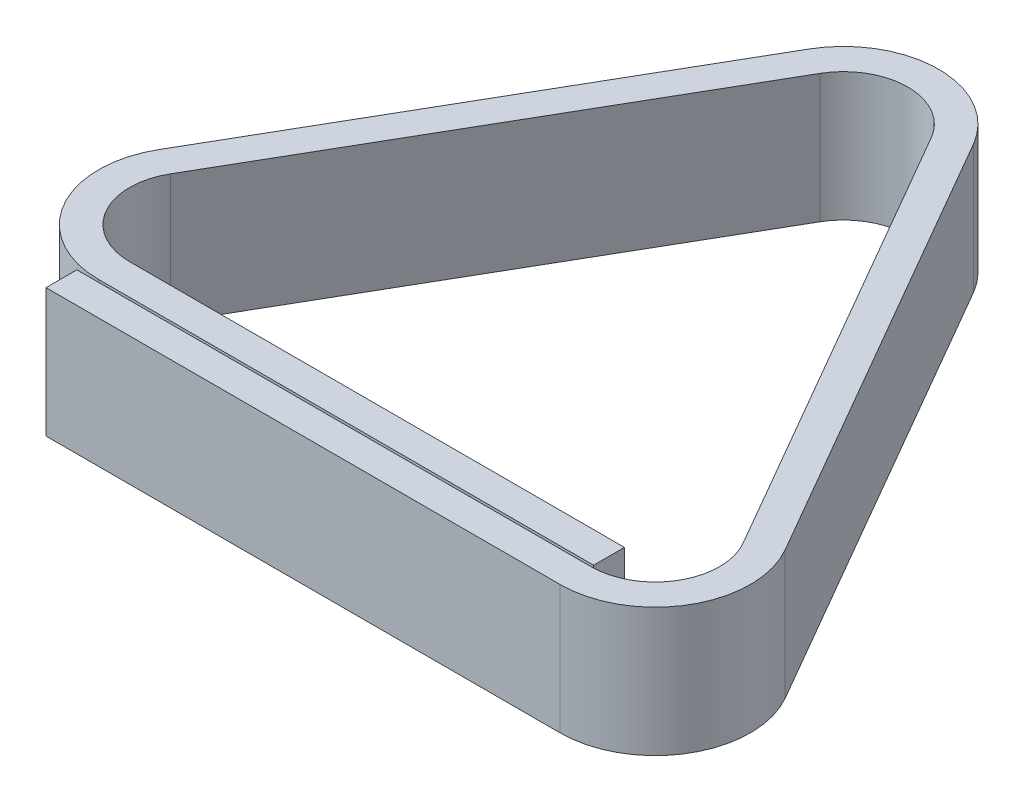
ISO-10303-21;
HEADER;
FILE_DESCRIPTION(('STEP AP214'),'2;1');
FILE_NAME('part.step','',(''),(''),'','','');
FILE_SCHEMA(('AUTOMOTIVE_DESIGN { 1 0 10303 214 1 1 1 1 }'));
ENDSEC;
DATA;
#1=APPLICATION_CONTEXT('core data for automotive mechanical design processes');
#2=APPLICATION_PROTOCOL_DEFINITION('international standard','automotive_design',2000,#1);
#3=PRODUCT_CONTEXT('',#1,'mechanical');
#4=PRODUCT('Part','Part','',(#3));
#5=PRODUCT_RELATED_PRODUCT_CATEGORY('part','',(#4));
#6=PRODUCT_DEFINITION_FORMATION('','',#4);
#7=PRODUCT_DEFINITION_CONTEXT('part definition',#1,'design');
#8=PRODUCT_DEFINITION('design','',#6,#7);
#9=PRODUCT_DEFINITION_SHAPE('','',#8);
#10=(LENGTH_UNIT() NAMED_UNIT(*) SI_UNIT(.MILLI.,.METRE.));
#11=(NAMED_UNIT(*) PLANE_ANGLE_UNIT() SI_UNIT($,.RADIAN.));
#12=(NAMED_UNIT(*) SI_UNIT($,.STERADIAN.) SOLID_ANGLE_UNIT());
#13=UNCERTAINTY_MEASURE_WITH_UNIT(LENGTH_MEASURE(1.E-05),#10,'distance_accuracy_value','');
#14=(GEOMETRIC_REPRESENTATION_CONTEXT(3) GLOBAL_UNCERTAINTY_ASSIGNED_CONTEXT((#13)) GLOBAL_UNIT_ASSIGNED_CONTEXT((#10,
#11,#12)) REPRESENTATION_CONTEXT('',''));
#15=CARTESIAN_POINT('',(0.,0.,0.));
#16=DIRECTION('',(0.,0.,1.));
#17=DIRECTION('',(1.,0.,0.));
#18=AXIS2_PLACEMENT_3D('',#15,#16,#17);
#19=CARTESIAN_POINT('',(0.,10.,0.));
#20=DIRECTION('',(1.,0.,0.));
#21=DIRECTION('',(0.,0.,-1.));
#22=AXIS2_PLACEMENT_3D('',#19,#20,#21);
#23=PLANE('',#22);
#24=DIRECTION('',(0.,0.,1.));
#25=VECTOR('',#24,1.);
#26=CARTESIAN_POINT('',(0.,0.,0.));
#27=LINE('',#26,#25);
#28=CARTESIAN_POINT('',(0.,0.,0.));
#29=VERTEX_POINT('',#28);
#30=CARTESIAN_POINT('',(0.,0.,2.4));
#31=VERTEX_POINT('',#30);
#32=EDGE_CURVE('E177',#29,#31,#27,.T.);
#33=ORIENTED_EDGE('',*,*,#32,.T.);
#34=DIRECTION('',(0.,-1.,0.));
#35=VECTOR('',#34,1.);
#36=CARTESIAN_POINT('',(0.,10.,2.4));
#37=LINE('',#36,#35);
#38=CARTESIAN_POINT('',(0.,10.,2.4));
#39=VERTEX_POINT('',#38);
#40=EDGE_CURVE('E11',#39,#31,#37,.T.);
#41=ORIENTED_EDGE('',*,*,#40,.F.);
#42=DIRECTION('',(0.,0.,1.));
#43=VECTOR('',#42,1.);
#44=CARTESIAN_POINT('',(0.,10.,0.));
#45=LINE('',#44,#43);
#46=CARTESIAN_POINT('',(0.,10.,0.));
#47=VERTEX_POINT('',#46);
#48=EDGE_CURVE('E207',#47,#39,#45,.T.);
#49=ORIENTED_EDGE('',*,*,#48,.F.);
#50=DIRECTION('',(0.,-1.,0.));
#51=VECTOR('',#50,1.);
#52=CARTESIAN_POINT('',(0.,10.,0.));
#53=LINE('',#52,#51);
#54=EDGE_CURVE('E173',#47,#29,#53,.T.);
#55=ORIENTED_EDGE('',*,*,#54,.T.);
#56=EDGE_LOOP('',(#33,#41,#49,#55));
#57=FACE_BOUND('',#56,.T.);
#58=ADVANCED_FACE('F33',(#57),#23,.F.);
#59=CARTESIAN_POINT('',(0.,10.,2.4));
#60=DIRECTION('',(0.,0.,-1.));
#61=DIRECTION('',(-1.,0.,0.));
#62=AXIS2_PLACEMENT_3D('',#59,#60,#61);
#63=PLANE('',#62);
#64=DIRECTION('',(1.,0.,0.));
#65=VECTOR('',#64,1.);
#66=CARTESIAN_POINT('',(0.,0.,2.4));
#67=LINE('',#66,#65);
#68=CARTESIAN_POINT('',(40.,0.,2.4));
#69=VERTEX_POINT('',#68);
#70=EDGE_CURVE('E180',#31,#69,#67,.T.);
#71=ORIENTED_EDGE('',*,*,#70,.T.);
#72=DIRECTION('',(0.,-1.,0.));
#73=VECTOR('',#72,1.);
#74=CARTESIAN_POINT('',(40.,10.,2.4));
#75=LINE('',#74,#73);
#76=CARTESIAN_POINT('',(40.,10.,2.4));
#77=VERTEX_POINT('',#76);
#78=EDGE_CURVE('E41',#77,#69,#75,.T.);
#79=ORIENTED_EDGE('',*,*,#78,.F.);
#80=DIRECTION('',(1.,0.,0.));
#81=VECTOR('',#80,1.);
#82=CARTESIAN_POINT('',(0.,10.,2.4));
#83=LINE('',#82,#81);
#84=EDGE_CURVE('E116',#39,#77,#83,.T.);
#85=ORIENTED_EDGE('',*,*,#84,.F.);
#86=ORIENTED_EDGE('',*,*,#40,.T.);
#87=EDGE_LOOP('',(#71,#79,#85,#86));
#88=FACE_BOUND('',#87,.T.);
#89=ADVANCED_FACE('F305',(#88),#63,.F.);
#90=CARTESIAN_POINT('',(40.,10.,-5.));
#91=DIRECTION('',(0.,-1.,0.));
#92=DIRECTION('',(0.,0.,-1.));
#93=AXIS2_PLACEMENT_3D('',#90,#91,#92);
#94=CYLINDRICAL_SURFACE('',#93,7.4);
#95=CARTESIAN_POINT('',(40.,0.,-5.));
#96=DIRECTION('',(0.,1.,0.));
#97=DIRECTION('',(0.,0.,1.));
#98=AXIS2_PLACEMENT_3D('',#95,#96,#97);
#99=CIRCLE('',#98,7.4);
#100=CARTESIAN_POINT('',(46.4085879880048,0.,-8.70000000000003));
#101=VERTEX_POINT('',#100);
#102=EDGE_CURVE('E182',#69,#101,#99,.T.);
#103=ORIENTED_EDGE('',*,*,#102,.T.);
#104=DIRECTION('',(0.,-1.,0.));
#105=VECTOR('',#104,1.);
#106=CARTESIAN_POINT('',(46.4085879880048,10.,-8.70000000000003));
#107=LINE('',#106,#105);
#108=CARTESIAN_POINT('',(46.4085879880048,10.,-8.70000000000003));
#109=VERTEX_POINT('',#108);
#110=EDGE_CURVE('E238',#109,#101,#107,.T.);
#111=ORIENTED_EDGE('',*,*,#110,.F.);
#112=CARTESIAN_POINT('',(40.,10.,-5.));
#113=DIRECTION('',(0.,1.,0.));
#114=DIRECTION('',(0.,0.,1.));
#115=AXIS2_PLACEMENT_3D('',#112,#113,#114);
#116=CIRCLE('',#115,7.4);
#117=EDGE_CURVE('E246',#77,#109,#116,.T.);
#118=ORIENTED_EDGE('',*,*,#117,.F.);
#119=ORIENTED_EDGE('',*,*,#78,.T.);
#120=EDGE_LOOP('',(#103,#111,#118,#119));
#121=FACE_BOUND('',#120,.T.);
#122=ADVANCED_FACE('F244',(#121),#94,.T.);
#123=CARTESIAN_POINT('',(46.4085879880048,10.,-8.70000000000003));
#124=DIRECTION('',(-0.866025403784436,0.,0.500000000000004));
#125=DIRECTION('',(0.500000000000004,0.,0.866025403784436));
#126=AXIS2_PLACEMENT_3D('',#123,#124,#125);
#127=PLANE('',#126);
#128=DIRECTION('',(-0.500000000000004,0.,-0.866025403784436));
#129=VECTOR('',#128,1.);
#130=CARTESIAN_POINT('',(46.4085879880048,0.,-8.70000000000003));
#131=LINE('',#130,#129);
#132=CARTESIAN_POINT('',(26.4085879880047,0.,-43.3410161513775));
#133=VERTEX_POINT('',#132);
#134=EDGE_CURVE('E184',#101,#133,#131,.T.);
#135=ORIENTED_EDGE('',*,*,#134,.T.);
#136=DIRECTION('',(0.,-1.,0.));
#137=VECTOR('',#136,1.);
#138=CARTESIAN_POINT('',(26.4085879880047,10.,-43.3410161513775));
#139=LINE('',#138,#137);
#140=CARTESIAN_POINT('',(26.4085879880047,10.,-43.3410161513775));
#141=VERTEX_POINT('',#140);
#142=EDGE_CURVE('E235',#141,#133,#139,.T.);
#143=ORIENTED_EDGE('',*,*,#142,.F.);
#144=DIRECTION('',(-0.500000000000004,0.,-0.866025403784436));
#145=VECTOR('',#144,1.);
#146=CARTESIAN_POINT('',(46.4085879880048,10.,-8.70000000000003));
#147=LINE('',#146,#145);
#148=EDGE_CURVE('E264',#109,#141,#147,.T.);
#149=ORIENTED_EDGE('',*,*,#148,.F.);
#150=ORIENTED_EDGE('',*,*,#110,.T.);
#151=EDGE_LOOP('',(#135,#143,#149,#150));
#152=FACE_BOUND('',#151,.T.);
#153=ADVANCED_FACE('F255',(#152),#127,.F.);
#154=CARTESIAN_POINT('',(19.9999999999998,10.,-39.6410161513774));
#155=DIRECTION('',(0.,-1.,0.));
#156=DIRECTION('',(0.,0.,-1.));
#157=AXIS2_PLACEMENT_3D('',#154,#155,#156);
#158=CYLINDRICAL_SURFACE('',#157,7.4);
#159=CARTESIAN_POINT('',(19.9999999999998,0.,-39.6410161513774));
#160=DIRECTION('',(0.,1.,0.));
#161=DIRECTION('',(0.,0.,1.));
#162=AXIS2_PLACEMENT_3D('',#159,#160,#161);
#163=CIRCLE('',#162,7.4);
#164=CARTESIAN_POINT('',(13.591412011995,0.,-43.3410161513775));
#165=VERTEX_POINT('',#164);
#166=EDGE_CURVE('E186',#133,#165,#163,.T.);
#167=ORIENTED_EDGE('',*,*,#166,.T.);
#168=DIRECTION('',(0.,-1.,0.));
#169=VECTOR('',#168,1.);
#170=CARTESIAN_POINT('',(13.591412011995,10.,-43.3410161513775));
#171=LINE('',#170,#169);
#172=CARTESIAN_POINT('',(13.591412011995,10.,-43.3410161513775));
#173=VERTEX_POINT('',#172);
#174=EDGE_CURVE('E232',#173,#165,#171,.T.);
#175=ORIENTED_EDGE('',*,*,#174,.F.);
#176=CARTESIAN_POINT('',(19.9999999999998,10.,-39.6410161513774));
#177=DIRECTION('',(0.,1.,0.));
#178=DIRECTION('',(0.,0.,1.));
#179=AXIS2_PLACEMENT_3D('',#176,#177,#178);
#180=CIRCLE('',#179,7.4);
#181=EDGE_CURVE('E261',#141,#173,#180,.T.);
#182=ORIENTED_EDGE('',*,*,#181,.F.);
#183=ORIENTED_EDGE('',*,*,#142,.T.);
#184=EDGE_LOOP('',(#167,#175,#182,#183));
#185=FACE_BOUND('',#184,.T.);
#186=ADVANCED_FACE('F259',(#185),#158,.T.);
#187=CARTESIAN_POINT('',(13.591412011995,10.,-43.3410161513775));
#188=DIRECTION('',(0.866025403784438,0.,0.5));
#189=DIRECTION('',(0.5,0.,-0.866025403784439));
#190=AXIS2_PLACEMENT_3D('',#187,#188,#189);
#191=PLANE('',#190);
#192=DIRECTION('',(-0.5,0.,0.866025403784438));
#193=VECTOR('',#192,1.);
#194=CARTESIAN_POINT('',(13.591412011995,0.,-43.3410161513775));
#195=LINE('',#194,#193);
#196=CARTESIAN_POINT('',(-4.90747728811198,0.,-11.2999999999999));
#197=VERTEX_POINT('',#196);
#198=EDGE_CURVE('E188',#165,#197,#195,.T.);
#199=ORIENTED_EDGE('',*,*,#198,.T.);
#200=DIRECTION('',(0.,-1.,0.));
#201=VECTOR('',#200,1.);
#202=CARTESIAN_POINT('',(-4.90747728811198,10.,-11.2999999999999));
#203=LINE('',#202,#201);
#204=CARTESIAN_POINT('',(-4.90747728811198,10.,-11.2999999999999));
#205=VERTEX_POINT('',#204);
#206=EDGE_CURVE('E229',#205,#197,#203,.T.);
#207=ORIENTED_EDGE('',*,*,#206,.F.);
#208=DIRECTION('',(-0.5,0.,0.866025403784438));
#209=VECTOR('',#208,1.);
#210=CARTESIAN_POINT('',(13.591412011995,10.,-43.3410161513775));
#211=LINE('',#210,#209);
#212=EDGE_CURVE('E263',#173,#205,#211,.T.);
#213=ORIENTED_EDGE('',*,*,#212,.F.);
#214=ORIENTED_EDGE('',*,*,#174,.T.);
#215=EDGE_LOOP('',(#199,#207,#213,#214));
#216=FACE_BOUND('',#215,.T.);
#217=ADVANCED_FACE('F318',(#216),#191,.F.);
#218=CARTESIAN_POINT('',(1.50111069989287,10.,-7.59999999999994));
#219=DIRECTION('',(0.,-1.,0.));
#220=DIRECTION('',(0.,0.,-1.));
#221=AXIS2_PLACEMENT_3D('',#218,#219,#220);
#222=CYLINDRICAL_SURFACE('',#221,7.4);
#223=CARTESIAN_POINT('',(1.50111069989287,0.,-7.59999999999994));
#224=DIRECTION('',(0.,1.,0.));
#225=DIRECTION('',(0.,0.,1.));
#226=AXIS2_PLACEMENT_3D('',#223,#224,#225);
#227=CIRCLE('',#226,7.4);
#228=CARTESIAN_POINT('',(1.50111069989288,0.,-0.199999999999939));
#229=VERTEX_POINT('',#228);
#230=EDGE_CURVE('E190',#197,#229,#227,.T.);
#231=ORIENTED_EDGE('',*,*,#230,.T.);
#232=DIRECTION('',(0.,-1.,0.));
#233=VECTOR('',#232,1.);
#234=CARTESIAN_POINT('',(1.50111069989288,10.,-0.199999999999939));
#235=LINE('',#234,#233);
#236=CARTESIAN_POINT('',(1.50111069989288,10.,-0.199999999999939));
#237=VERTEX_POINT('',#236);
#238=EDGE_CURVE('E226',#237,#229,#235,.T.);
#239=ORIENTED_EDGE('',*,*,#238,.F.);
#240=CARTESIAN_POINT('',(1.50111069989287,10.,-7.59999999999994));
#241=DIRECTION('',(0.,1.,0.));
#242=DIRECTION('',(0.,0.,1.));
#243=AXIS2_PLACEMENT_3D('',#240,#241,#242);
#244=CIRCLE('',#243,7.4);
#245=EDGE_CURVE('E266',#205,#237,#244,.T.);
#246=ORIENTED_EDGE('',*,*,#245,.F.);
#247=ORIENTED_EDGE('',*,*,#206,.T.);
#248=EDGE_LOOP('',(#231,#239,#246,#247));
#249=FACE_BOUND('',#248,.T.);
#250=ADVANCED_FACE('F321',(#249),#222,.T.);
#251=CARTESIAN_POINT('',(1.50111069989288,10.,-0.199999999999939));
#252=DIRECTION('',(0.,0.,-1.));
#253=DIRECTION('',(-1.,0.,0.));
#254=AXIS2_PLACEMENT_3D('',#251,#252,#253);
#255=PLANE('',#254);
#256=DIRECTION('',(1.,0.,0.));
#257=VECTOR('',#256,1.);
#258=CARTESIAN_POINT('',(1.50111069989288,0.,-0.199999999999939));
#259=LINE('',#258,#257);
#260=CARTESIAN_POINT('',(40.,0.,-0.2));
#261=VERTEX_POINT('',#260);
#262=EDGE_CURVE('E192',#229,#261,#259,.T.);
#263=ORIENTED_EDGE('',*,*,#262,.T.);
#264=DIRECTION('',(0.,-1.,0.));
#265=VECTOR('',#264,1.);
#266=CARTESIAN_POINT('',(40.,10.,-0.2));
#267=LINE('',#266,#265);
#268=CARTESIAN_POINT('',(40.,10.,-0.2));
#269=VERTEX_POINT('',#268);
#270=EDGE_CURVE('E223',#269,#261,#267,.T.);
#271=ORIENTED_EDGE('',*,*,#270,.F.);
#272=DIRECTION('',(1.,0.,0.));
#273=VECTOR('',#272,1.);
#274=CARTESIAN_POINT('',(1.50111069989288,10.,-0.199999999999939));
#275=LINE('',#274,#273);
#276=EDGE_CURVE('E272',#237,#269,#275,.T.);
#277=ORIENTED_EDGE('',*,*,#276,.F.);
#278=ORIENTED_EDGE('',*,*,#238,.T.);
#279=EDGE_LOOP('',(#263,#271,#277,#278));
#280=FACE_BOUND('',#279,.T.);
#281=ADVANCED_FACE('F325',(#280),#255,.F.);
#282=CARTESIAN_POINT('',(40.,10.,-2.6));
#283=DIRECTION('',(-1.,0.,0.));
#284=DIRECTION('',(0.,0.,1.));
#285=AXIS2_PLACEMENT_3D('',#282,#283,#284);
#286=PLANE('',#285);
#287=DIRECTION('',(0.,0.,-1.));
#288=VECTOR('',#287,1.);
#289=CARTESIAN_POINT('',(40.,0.,-2.6));
#290=LINE('',#289,#288);
#291=CARTESIAN_POINT('',(40.,0.,-2.6));
#292=VERTEX_POINT('',#291);
#293=EDGE_CURVE('E194',#261,#292,#290,.T.);
#294=ORIENTED_EDGE('',*,*,#293,.T.);
#295=DIRECTION('',(0.,-1.,0.));
#296=VECTOR('',#295,1.);
#297=CARTESIAN_POINT('',(40.,10.,-2.6));
#298=LINE('',#297,#296);
#299=CARTESIAN_POINT('',(40.,10.,-2.6));
#300=VERTEX_POINT('',#299);
#301=EDGE_CURVE('E220',#300,#292,#298,.T.);
#302=ORIENTED_EDGE('',*,*,#301,.F.);
#303=DIRECTION('',(0.,0.,-1.));
#304=VECTOR('',#303,1.);
#305=CARTESIAN_POINT('',(40.,10.,-2.6));
#306=LINE('',#305,#304);
#307=EDGE_CURVE('E274',#269,#300,#306,.T.);
#308=ORIENTED_EDGE('',*,*,#307,.F.);
#309=ORIENTED_EDGE('',*,*,#270,.T.);
#310=EDGE_LOOP('',(#294,#302,#308,#309));
#311=FACE_BOUND('',#310,.T.);
#312=ADVANCED_FACE('F329',(#311),#286,.F.);
#313=CARTESIAN_POINT('',(1.50111069989288,10.,-2.59999999999994));
#314=DIRECTION('',(0.,0.,1.));
#315=DIRECTION('',(1.,0.,0.));
#316=AXIS2_PLACEMENT_3D('',#313,#314,#315);
#317=PLANE('',#316);
#318=DIRECTION('',(-1.,0.,0.));
#319=VECTOR('',#318,1.);
#320=CARTESIAN_POINT('',(1.50111069989288,0.,-2.59999999999994));
#321=LINE('',#320,#319);
#322=CARTESIAN_POINT('',(1.50111069989287,0.,-2.59999999999994));
#323=VERTEX_POINT('',#322);
#324=EDGE_CURVE('E196',#292,#323,#321,.T.);
#325=ORIENTED_EDGE('',*,*,#324,.T.);
#326=DIRECTION('',(0.,-1.,0.));
#327=VECTOR('',#326,1.);
#328=CARTESIAN_POINT('',(1.50111069989287,10.,-2.59999999999994));
#329=LINE('',#328,#327);
#330=CARTESIAN_POINT('',(1.50111069989287,10.,-2.59999999999994));
#331=VERTEX_POINT('',#330);
#332=EDGE_CURVE('E217',#331,#323,#329,.T.);
#333=ORIENTED_EDGE('',*,*,#332,.F.);
#334=DIRECTION('',(-1.,0.,0.));
#335=VECTOR('',#334,1.);
#336=CARTESIAN_POINT('',(1.50111069989288,10.,-2.59999999999994));
#337=LINE('',#336,#335);
#338=EDGE_CURVE('E276',#300,#331,#337,.T.);
#339=ORIENTED_EDGE('',*,*,#338,.F.);
#340=ORIENTED_EDGE('',*,*,#301,.T.);
#341=EDGE_LOOP('',(#325,#333,#339,#340));
#342=FACE_BOUND('',#341,.T.);
#343=ADVANCED_FACE('F333',(#342),#317,.F.);
#344=CARTESIAN_POINT('',(1.50111069989287,10.,-7.59999999999994));
#345=DIRECTION('',(0.,-1.,0.));
#346=DIRECTION('',(0.,0.,-1.));
#347=AXIS2_PLACEMENT_3D('',#344,#345,#346);
#348=CYLINDRICAL_SURFACE('',#347,5.);
#349=CARTESIAN_POINT('',(1.50111069989287,0.,-7.59999999999994));
#350=DIRECTION('',(0.,-1.,0.));
#351=DIRECTION('',(0.,0.,1.));
#352=AXIS2_PLACEMENT_3D('',#349,#350,#351);
#353=CIRCLE('',#352,5.);
#354=CARTESIAN_POINT('',(-2.82901631902932,0.,-10.0999999999999));
#355=VERTEX_POINT('',#354);
#356=EDGE_CURVE('E198',#323,#355,#353,.T.);
#357=ORIENTED_EDGE('',*,*,#356,.T.);
#358=DIRECTION('',(0.,-1.,0.));
#359=VECTOR('',#358,1.);
#360=CARTESIAN_POINT('',(-2.82901631902932,10.,-10.0999999999999));
#361=LINE('',#360,#359);
#362=CARTESIAN_POINT('',(-2.82901631902932,10.,-10.0999999999999));
#363=VERTEX_POINT('',#362);
#364=EDGE_CURVE('E214',#363,#355,#361,.T.);
#365=ORIENTED_EDGE('',*,*,#364,.F.);
#366=CARTESIAN_POINT('',(1.50111069989287,10.,-7.59999999999994));
#367=DIRECTION('',(0.,-1.,0.));
#368=DIRECTION('',(0.,0.,1.));
#369=AXIS2_PLACEMENT_3D('',#366,#367,#368);
#370=CIRCLE('',#369,5.);
#371=EDGE_CURVE('E278',#331,#363,#370,.T.);
#372=ORIENTED_EDGE('',*,*,#371,.F.);
#373=ORIENTED_EDGE('',*,*,#332,.T.);
#374=EDGE_LOOP('',(#357,#365,#372,#373));
#375=FACE_BOUND('',#374,.T.);
#376=ADVANCED_FACE('F337',(#375),#348,.F.);
#377=CARTESIAN_POINT('',(15.6698729810776,10.,-42.1410161513775));
#378=DIRECTION('',(-0.866025403784438,0.,-0.5));
#379=DIRECTION('',(-0.5,0.,0.866025403784438));
#380=AXIS2_PLACEMENT_3D('',#377,#378,#379);
#381=PLANE('',#380);
#382=DIRECTION('',(0.5,0.,-0.866025403784439));
#383=VECTOR('',#382,1.);
#384=CARTESIAN_POINT('',(15.6698729810776,0.,-42.1410161513775));
#385=LINE('',#384,#383);
#386=CARTESIAN_POINT('',(15.6698729810776,0.,-42.1410161513775));
#387=VERTEX_POINT('',#386);
#388=EDGE_CURVE('E200',#355,#387,#385,.T.);
#389=ORIENTED_EDGE('',*,*,#388,.T.);
#390=DIRECTION('',(0.,-1.,0.));
#391=VECTOR('',#390,1.);
#392=CARTESIAN_POINT('',(15.6698729810776,10.,-42.1410161513775));
#393=LINE('',#392,#391);
#394=CARTESIAN_POINT('',(15.6698729810776,10.,-42.1410161513775));
#395=VERTEX_POINT('',#394);
#396=EDGE_CURVE('E211',#395,#387,#393,.T.);
#397=ORIENTED_EDGE('',*,*,#396,.F.);
#398=DIRECTION('',(0.5,0.,-0.866025403784439));
#399=VECTOR('',#398,1.);
#400=CARTESIAN_POINT('',(15.6698729810776,10.,-42.1410161513775));
#401=LINE('',#400,#399);
#402=EDGE_CURVE('E280',#363,#395,#401,.T.);
#403=ORIENTED_EDGE('',*,*,#402,.F.);
#404=ORIENTED_EDGE('',*,*,#364,.T.);
#405=EDGE_LOOP('',(#389,#397,#403,#404));
#406=FACE_BOUND('',#405,.T.);
#407=ADVANCED_FACE('F286',(#406),#381,.F.);
#408=CARTESIAN_POINT('',(19.9999999999998,10.,-39.6410161513774));
#409=DIRECTION('',(0.,-1.,0.));
#410=DIRECTION('',(0.,0.,-1.));
#411=AXIS2_PLACEMENT_3D('',#408,#409,#410);
#412=CYLINDRICAL_SURFACE('',#411,5.00000000000001);
#413=CARTESIAN_POINT('',(19.9999999999998,0.,-39.6410161513774));
#414=DIRECTION('',(0.,-1.,0.));
#415=DIRECTION('',(0.,0.,1.));
#416=AXIS2_PLACEMENT_3D('',#413,#414,#415);
#417=CIRCLE('',#416,5.00000000000001);
#418=CARTESIAN_POINT('',(24.330127018922,0.,-42.1410161513775));
#419=VERTEX_POINT('',#418);
#420=EDGE_CURVE('E202',#387,#419,#417,.T.);
#421=ORIENTED_EDGE('',*,*,#420,.T.);
#422=DIRECTION('',(0.,-1.,0.));
#423=VECTOR('',#422,1.);
#424=CARTESIAN_POINT('',(24.330127018922,10.,-42.1410161513775));
#425=LINE('',#424,#423);
#426=CARTESIAN_POINT('',(24.330127018922,10.,-42.1410161513775));
#427=VERTEX_POINT('',#426);
#428=EDGE_CURVE('E168',#427,#419,#425,.T.);
#429=ORIENTED_EDGE('',*,*,#428,.F.);
#430=CARTESIAN_POINT('',(19.9999999999998,10.,-39.6410161513774));
#431=DIRECTION('',(0.,-1.,0.));
#432=DIRECTION('',(0.,0.,1.));
#433=AXIS2_PLACEMENT_3D('',#430,#431,#432);
#434=CIRCLE('',#433,5.00000000000001);
#435=EDGE_CURVE('E159',#395,#427,#434,.T.);
#436=ORIENTED_EDGE('',*,*,#435,.F.);
#437=ORIENTED_EDGE('',*,*,#396,.T.);
#438=EDGE_LOOP('',(#421,#429,#436,#437));
#439=FACE_BOUND('',#438,.T.);
#440=ADVANCED_FACE('F290',(#439),#412,.F.);
#441=CARTESIAN_POINT('',(44.3301270189222,10.,-7.50000000000002));
#442=DIRECTION('',(0.866025403784436,0.,-0.500000000000004));
#443=DIRECTION('',(-0.500000000000004,0.,-0.866025403784436));
#444=AXIS2_PLACEMENT_3D('',#441,#442,#443);
#445=PLANE('',#444);
#446=DIRECTION('',(0.500000000000004,0.,0.866025403784436));
#447=VECTOR('',#446,1.);
#448=CARTESIAN_POINT('',(44.3301270189222,0.,-7.50000000000002));
#449=LINE('',#448,#447);
#450=CARTESIAN_POINT('',(44.3301270189222,0.,-7.50000000000002));
#451=VERTEX_POINT('',#450);
#452=EDGE_CURVE('E167',#419,#451,#449,.T.);
#453=ORIENTED_EDGE('',*,*,#452,.T.);
#454=DIRECTION('',(0.,-1.,0.));
#455=VECTOR('',#454,1.);
#456=CARTESIAN_POINT('',(44.3301270189222,10.,-7.50000000000002));
#457=LINE('',#456,#455);
#458=CARTESIAN_POINT('',(44.3301270189222,10.,-7.50000000000002));
#459=VERTEX_POINT('',#458);
#460=EDGE_CURVE('E164',#459,#451,#457,.T.);
#461=ORIENTED_EDGE('',*,*,#460,.F.);
#462=DIRECTION('',(0.500000000000004,0.,0.866025403784436));
#463=VECTOR('',#462,1.);
#464=CARTESIAN_POINT('',(44.3301270189222,10.,-7.50000000000002));
#465=LINE('',#464,#463);
#466=EDGE_CURVE('E153',#427,#459,#465,.T.);
#467=ORIENTED_EDGE('',*,*,#466,.F.);
#468=ORIENTED_EDGE('',*,*,#428,.T.);
#469=EDGE_LOOP('',(#453,#461,#467,#468));
#470=FACE_BOUND('',#469,.T.);
#471=ADVANCED_FACE('F165',(#470),#445,.F.);
#472=CARTESIAN_POINT('',(40.,10.,-5.));
#473=DIRECTION('',(0.,-1.,0.));
#474=DIRECTION('',(0.,0.,-1.));
#475=AXIS2_PLACEMENT_3D('',#472,#473,#474);
#476=CYLINDRICAL_SURFACE('',#475,5.);
#477=CARTESIAN_POINT('',(40.,0.,-5.));
#478=DIRECTION('',(0.,-1.,0.));
#479=DIRECTION('',(0.,0.,1.));
#480=AXIS2_PLACEMENT_3D('',#477,#478,#479);
#481=CIRCLE('',#480,5.);
#482=CARTESIAN_POINT('',(40.,0.,0.));
#483=VERTEX_POINT('',#482);
#484=EDGE_CURVE('E102',#451,#483,#481,.T.);
#485=ORIENTED_EDGE('',*,*,#484,.T.);
#486=DIRECTION('',(0.,-1.,0.));
#487=VECTOR('',#486,1.);
#488=CARTESIAN_POINT('',(40.,10.,0.));
#489=LINE('',#488,#487);
#490=CARTESIAN_POINT('',(40.,10.,0.));
#491=VERTEX_POINT('',#490);
#492=EDGE_CURVE('E169',#491,#483,#489,.T.);
#493=ORIENTED_EDGE('',*,*,#492,.F.);
#494=CARTESIAN_POINT('',(40.,10.,-5.));
#495=DIRECTION('',(0.,-1.,0.));
#496=DIRECTION('',(0.,0.,1.));
#497=AXIS2_PLACEMENT_3D('',#494,#495,#496);
#498=CIRCLE('',#497,5.);
#499=EDGE_CURVE('E157',#459,#491,#498,.T.);
#500=ORIENTED_EDGE('',*,*,#499,.F.);
#501=ORIENTED_EDGE('',*,*,#460,.T.);
#502=EDGE_LOOP('',(#485,#493,#500,#501));
#503=FACE_BOUND('',#502,.T.);
#504=ADVANCED_FACE('F171',(#503),#476,.F.);
#505=CARTESIAN_POINT('',(0.,10.,0.));
#506=DIRECTION('',(0.,0.,1.));
#507=DIRECTION('',(1.,0.,0.));
#508=AXIS2_PLACEMENT_3D('',#505,#506,#507);
#509=PLANE('',#508);
#510=DIRECTION('',(-1.,0.,0.));
#511=VECTOR('',#510,1.);
#512=CARTESIAN_POINT('',(0.,0.,0.));
#513=LINE('',#512,#511);
#514=EDGE_CURVE('E108',#483,#29,#513,.T.);
#515=ORIENTED_EDGE('',*,*,#514,.T.);
#516=ORIENTED_EDGE('',*,*,#54,.F.);
#517=DIRECTION('',(-1.,0.,0.));
#518=VECTOR('',#517,1.);
#519=CARTESIAN_POINT('',(0.,10.,0.));
#520=LINE('',#519,#518);
#521=EDGE_CURVE('E49',#491,#47,#520,.T.);
#522=ORIENTED_EDGE('',*,*,#521,.F.);
#523=ORIENTED_EDGE('',*,*,#492,.T.);
#524=EDGE_LOOP('',(#515,#516,#522,#523));
#525=FACE_BOUND('',#524,.T.);
#526=ADVANCED_FACE('F294',(#525),#509,.F.);
#527=CARTESIAN_POINT('',(40.,10.,-5.));
#528=DIRECTION('',(0.,1.,0.));
#529=DIRECTION('',(0.,0.,1.));
#530=AXIS2_PLACEMENT_3D('',#527,#528,#529);
#531=PLANE('',#530);
#532=ORIENTED_EDGE('',*,*,#48,.T.);
#533=ORIENTED_EDGE('',*,*,#84,.T.);
#534=ORIENTED_EDGE('',*,*,#117,.T.);
#535=ORIENTED_EDGE('',*,*,#148,.T.);
#536=ORIENTED_EDGE('',*,*,#181,.T.);
#537=ORIENTED_EDGE('',*,*,#212,.T.);
#538=ORIENTED_EDGE('',*,*,#245,.T.);
#539=ORIENTED_EDGE('',*,*,#276,.T.);
#540=ORIENTED_EDGE('',*,*,#307,.T.);
#541=ORIENTED_EDGE('',*,*,#338,.T.);
#542=ORIENTED_EDGE('',*,*,#371,.T.);
#543=ORIENTED_EDGE('',*,*,#402,.T.);
#544=ORIENTED_EDGE('',*,*,#435,.T.);
#545=ORIENTED_EDGE('',*,*,#466,.T.);
#546=ORIENTED_EDGE('',*,*,#499,.T.);
#547=ORIENTED_EDGE('',*,*,#521,.T.);
#548=EDGE_LOOP('',(#532,#533,#534,#535,#536,#537,#538,#539,#540,#541,#542,#543,#544,#545,#546,#547));
#549=FACE_BOUND('',#548,.T.);
#550=ADVANCED_FACE('F155',(#549),#531,.T.);
#551=CARTESIAN_POINT('',(40.,0.,-5.));
#552=DIRECTION('',(0.,1.,0.));
#553=DIRECTION('',(0.,0.,1.));
#554=AXIS2_PLACEMENT_3D('',#551,#552,#553);
#555=PLANE('',#554);
#556=ORIENTED_EDGE('',*,*,#32,.F.);
#557=ORIENTED_EDGE('',*,*,#514,.F.);
#558=ORIENTED_EDGE('',*,*,#484,.F.);
#559=ORIENTED_EDGE('',*,*,#452,.F.);
#560=ORIENTED_EDGE('',*,*,#420,.F.);
#561=ORIENTED_EDGE('',*,*,#388,.F.);
#562=ORIENTED_EDGE('',*,*,#356,.F.);
#563=ORIENTED_EDGE('',*,*,#324,.F.);
#564=ORIENTED_EDGE('',*,*,#293,.F.);
#565=ORIENTED_EDGE('',*,*,#262,.F.);
#566=ORIENTED_EDGE('',*,*,#230,.F.);
#567=ORIENTED_EDGE('',*,*,#198,.F.);
#568=ORIENTED_EDGE('',*,*,#166,.F.);
#569=ORIENTED_EDGE('',*,*,#134,.F.);
#570=ORIENTED_EDGE('',*,*,#102,.F.);
#571=ORIENTED_EDGE('',*,*,#70,.F.);
#572=EDGE_LOOP('',(#556,#557,#558,#559,#560,#561,#562,#563,#564,#565,#566,#567,#568,#569,#570,#571));
#573=FACE_BOUND('',#572,.T.);
#574=ADVANCED_FACE('F250',(#573),#555,.F.);
#575=CLOSED_SHELL('',(#58,#89,#122,#153,#186,#217,#250,#281,#312,#343,#376,#407,#440,#471,#504,
#526,#550,#574));
#576=MANIFOLD_SOLID_BREP('B2',#575);
#577=ADVANCED_BREP_SHAPE_REPRESENTATION('',(#18,#576),#14);
#578=SHAPE_DEFINITION_REPRESENTATION(#9,#577);
ENDSEC;
END-ISO-10303-21;
